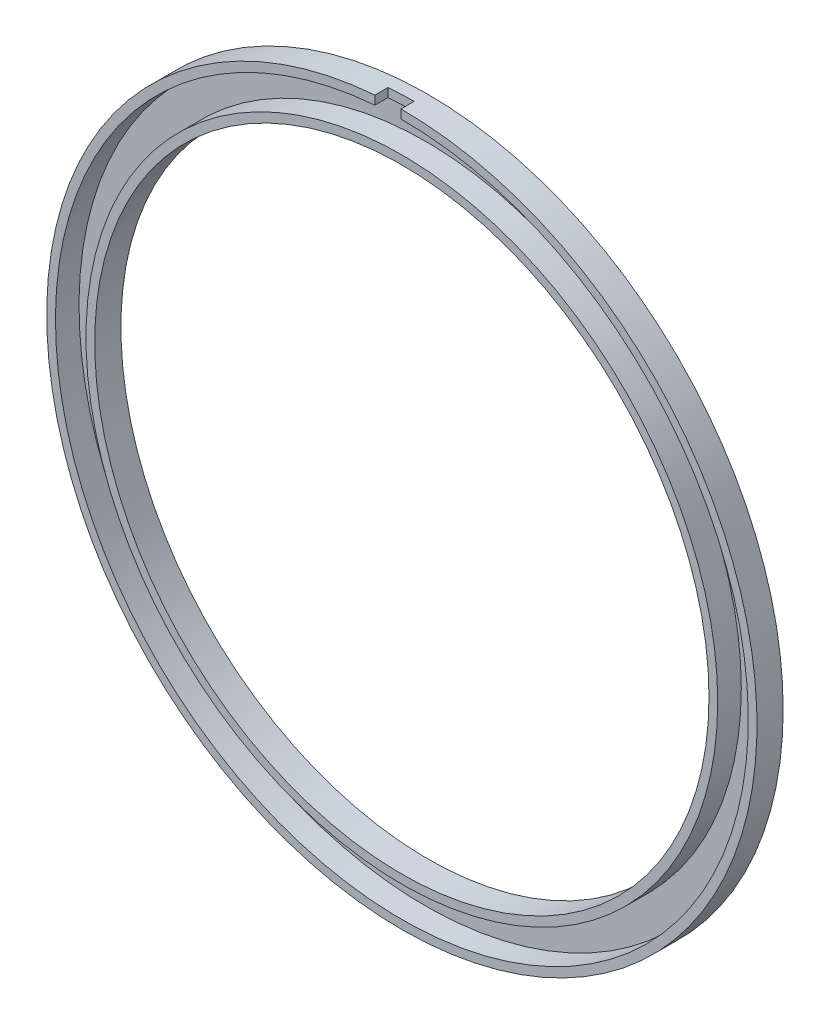
ISO-10303-21;
HEADER;
FILE_DESCRIPTION(('STEP AP214'),'2;1');
FILE_NAME('part.step','',(''),(''),'','','');
FILE_SCHEMA(('AUTOMOTIVE_DESIGN { 1 0 10303 214 1 1 1 1 }'));
ENDSEC;
DATA;
#1=APPLICATION_CONTEXT('core data for automotive mechanical design processes');
#2=APPLICATION_PROTOCOL_DEFINITION('international standard','automotive_design',2000,#1);
#3=PRODUCT_CONTEXT('',#1,'mechanical');
#4=PRODUCT('Part','Part','',(#3));
#5=PRODUCT_RELATED_PRODUCT_CATEGORY('part','',(#4));
#6=PRODUCT_DEFINITION_FORMATION('','',#4);
#7=PRODUCT_DEFINITION_CONTEXT('part definition',#1,'design');
#8=PRODUCT_DEFINITION('design','',#6,#7);
#9=PRODUCT_DEFINITION_SHAPE('','',#8);
#10=(LENGTH_UNIT() NAMED_UNIT(*) SI_UNIT(.MILLI.,.METRE.));
#11=(NAMED_UNIT(*) PLANE_ANGLE_UNIT() SI_UNIT($,.RADIAN.));
#12=(NAMED_UNIT(*) SI_UNIT($,.STERADIAN.) SOLID_ANGLE_UNIT());
#13=UNCERTAINTY_MEASURE_WITH_UNIT(LENGTH_MEASURE(1.E-05),#10,'distance_accuracy_value','');
#14=(GEOMETRIC_REPRESENTATION_CONTEXT(3) GLOBAL_UNCERTAINTY_ASSIGNED_CONTEXT((#13)) GLOBAL_UNIT_ASSIGNED_CONTEXT((#10,
#11,#12)) REPRESENTATION_CONTEXT('',''));
#15=CARTESIAN_POINT('',(0.,0.,0.));
#16=DIRECTION('',(0.,0.,1.));
#17=DIRECTION('',(1.,0.,0.));
#18=AXIS2_PLACEMENT_3D('',#15,#16,#17);
#19=CARTESIAN_POINT('',(0.,0.,0.6));
#20=DIRECTION('',(0.,0.,1.));
#21=DIRECTION('',(1.,0.,0.));
#22=AXIS2_PLACEMENT_3D('',#19,#20,#21);
#23=PLANE('',#22);
#24=CARTESIAN_POINT('',(0.,0.,0.6));
#25=DIRECTION('',(0.,0.,1.));
#26=DIRECTION('',(1.,0.,0.));
#27=AXIS2_PLACEMENT_3D('',#24,#25,#26);
#28=CIRCLE('',#27,72.4);
#29=CARTESIAN_POINT('',(72.4,0.,0.6));
#30=VERTEX_POINT('',#29);
#31=EDGE_CURVE('E58',#30,#30,#28,.T.);
#32=ORIENTED_EDGE('',*,*,#31,.F.);
#33=EDGE_LOOP('',(#32));
#34=FACE_BOUND('',#33,.T.);
#35=CARTESIAN_POINT('',(0.,0.,0.6));
#36=DIRECTION('',(0.,0.,1.));
#37=DIRECTION('',(1.,0.,0.));
#38=AXIS2_PLACEMENT_3D('',#35,#36,#37);
#39=CIRCLE('',#38,79.4);
#40=CARTESIAN_POINT('',(79.4,0.,0.6));
#41=VERTEX_POINT('',#40);
#42=EDGE_CURVE('E12',#41,#41,#39,.T.);
#43=ORIENTED_EDGE('',*,*,#42,.T.);
#44=EDGE_LOOP('',(#43));
#45=FACE_BOUND('',#44,.T.);
#46=ADVANCED_FACE('F50',(#34,#45),#23,.T.);
#47=CARTESIAN_POINT('',(0.,0.,0.));
#48=DIRECTION('',(0.,0.,1.));
#49=DIRECTION('',(1.,0.,0.));
#50=AXIS2_PLACEMENT_3D('',#47,#48,#49);
#51=PLANE('',#50);
#52=CARTESIAN_POINT('',(0.,0.,0.));
#53=DIRECTION('',(0.,0.,1.));
#54=DIRECTION('',(1.,0.,0.));
#55=AXIS2_PLACEMENT_3D('',#52,#53,#54);
#56=CIRCLE('',#55,81.4);
#57=CARTESIAN_POINT('',(81.4,0.,0.));
#58=VERTEX_POINT('',#57);
#59=EDGE_CURVE('E105',#58,#58,#56,.T.);
#60=ORIENTED_EDGE('',*,*,#59,.F.);
#61=EDGE_LOOP('',(#60));
#62=FACE_BOUND('',#61,.T.);
#63=CARTESIAN_POINT('',(0.,0.,0.));
#64=DIRECTION('',(0.,0.,1.));
#65=DIRECTION('',(1.,0.,0.));
#66=AXIS2_PLACEMENT_3D('',#63,#64,#65);
#67=CIRCLE('',#66,70.4);
#68=CARTESIAN_POINT('',(70.4,0.,0.));
#69=VERTEX_POINT('',#68);
#70=EDGE_CURVE('E95',#69,#69,#67,.T.);
#71=ORIENTED_EDGE('',*,*,#70,.T.);
#72=EDGE_LOOP('',(#71));
#73=FACE_BOUND('',#72,.T.);
#74=ADVANCED_FACE('F52',(#62,#73),#51,.F.);
#75=CARTESIAN_POINT('',(0.,0.,6.));
#76=DIRECTION('',(0.,0.,-1.));
#77=DIRECTION('',(-1.,0.,0.));
#78=AXIS2_PLACEMENT_3D('',#75,#76,#77);
#79=CYLINDRICAL_SURFACE('',#78,70.4);
#80=CARTESIAN_POINT('',(0.,0.,6.));
#81=DIRECTION('',(0.,0.,1.));
#82=DIRECTION('',(1.,0.,0.));
#83=AXIS2_PLACEMENT_3D('',#80,#81,#82);
#84=CIRCLE('',#83,70.4);
#85=CARTESIAN_POINT('',(70.4,0.,6.));
#86=VERTEX_POINT('',#85);
#87=EDGE_CURVE('E122',#86,#86,#84,.T.);
#88=ORIENTED_EDGE('',*,*,#87,.T.);
#89=EDGE_LOOP('',(#88));
#90=FACE_BOUND('',#89,.T.);
#91=ORIENTED_EDGE('',*,*,#70,.F.);
#92=EDGE_LOOP('',(#91));
#93=FACE_BOUND('',#92,.T.);
#94=ADVANCED_FACE('F154',(#90,#93),#79,.F.);
#95=CARTESIAN_POINT('',(0.,0.,6.));
#96=DIRECTION('',(0.,0.,-1.));
#97=DIRECTION('',(-1.,0.,0.));
#98=AXIS2_PLACEMENT_3D('',#95,#96,#97);
#99=CYLINDRICAL_SURFACE('',#98,72.4);
#100=ORIENTED_EDGE('',*,*,#31,.T.);
#101=EDGE_LOOP('',(#100));
#102=FACE_BOUND('',#101,.T.);
#103=CARTESIAN_POINT('',(0.,0.,6.));
#104=DIRECTION('',(0.,0.,1.));
#105=DIRECTION('',(1.,0.,0.));
#106=AXIS2_PLACEMENT_3D('',#103,#104,#105);
#107=CIRCLE('',#106,72.4);
#108=CARTESIAN_POINT('',(72.4,0.,6.));
#109=VERTEX_POINT('',#108);
#110=EDGE_CURVE('E125',#109,#109,#107,.T.);
#111=ORIENTED_EDGE('',*,*,#110,.F.);
#112=EDGE_LOOP('',(#111));
#113=FACE_BOUND('',#112,.T.);
#114=ADVANCED_FACE('F132',(#102,#113),#99,.T.);
#115=CARTESIAN_POINT('',(0.,0.,6.));
#116=DIRECTION('',(0.,0.,1.));
#117=DIRECTION('',(1.,0.,0.));
#118=AXIS2_PLACEMENT_3D('',#115,#116,#117);
#119=PLANE('',#118);
#120=ORIENTED_EDGE('',*,*,#87,.F.);
#121=EDGE_LOOP('',(#120));
#122=FACE_BOUND('',#121,.T.);
#123=ORIENTED_EDGE('',*,*,#110,.T.);
#124=EDGE_LOOP('',(#123));
#125=FACE_BOUND('',#124,.T.);
#126=ADVANCED_FACE('F140',(#122,#125),#119,.T.);
#127=CARTESIAN_POINT('',(0.,0.,6.));
#128=DIRECTION('',(0.,0.,-1.));
#129=DIRECTION('',(-1.,0.,0.));
#130=AXIS2_PLACEMENT_3D('',#127,#128,#129);
#131=CYLINDRICAL_SURFACE('',#130,79.4);
#132=ORIENTED_EDGE('',*,*,#42,.F.);
#133=EDGE_LOOP('',(#132));
#134=FACE_BOUND('',#133,.T.);
#135=DIRECTION('',(0.,0.,-1.));
#136=VECTOR('',#135,1.);
#137=CARTESIAN_POINT('',(-0.182652596853231,79.3997899117426,6.));
#138=LINE('',#137,#136);
#139=CARTESIAN_POINT('',(-0.182652596853231,79.3997899117426,6.));
#140=VERTEX_POINT('',#139);
#141=CARTESIAN_POINT('',(-0.182652596853231,79.3997899117426,3.));
#142=VERTEX_POINT('',#141);
#143=EDGE_CURVE('E115',#140,#142,#138,.T.);
#144=ORIENTED_EDGE('',*,*,#143,.T.);
#145=CARTESIAN_POINT('',(0.,0.,3.));
#146=DIRECTION('',(0.,0.,1.));
#147=DIRECTION('',(1.,0.,0.));
#148=AXIS2_PLACEMENT_3D('',#145,#146,#147);
#149=CIRCLE('',#148,79.4);
#150=CARTESIAN_POINT('',(-6.18265259685323,79.1589212083302,3.));
#151=VERTEX_POINT('',#150);
#152=EDGE_CURVE('E94',#142,#151,#149,.T.);
#153=ORIENTED_EDGE('',*,*,#152,.T.);
#154=DIRECTION('',(0.,0.,-1.));
#155=VECTOR('',#154,1.);
#156=CARTESIAN_POINT('',(-6.18265259685323,79.1589212083302,6.));
#157=LINE('',#156,#155);
#158=CARTESIAN_POINT('',(-6.18265259685323,79.1589212083302,6.));
#159=VERTEX_POINT('',#158);
#160=EDGE_CURVE('E65',#159,#151,#157,.T.);
#161=ORIENTED_EDGE('',*,*,#160,.F.);
#162=CARTESIAN_POINT('',(0.,0.,6.));
#163=DIRECTION('',(0.,0.,1.));
#164=DIRECTION('',(1.,0.,0.));
#165=AXIS2_PLACEMENT_3D('',#162,#163,#164);
#166=CIRCLE('',#165,79.4);
#167=EDGE_CURVE('E92',#159,#140,#166,.T.);
#168=ORIENTED_EDGE('',*,*,#167,.T.);
#169=EDGE_LOOP('',(#144,#153,#161,#168));
#170=FACE_BOUND('',#169,.T.);
#171=ADVANCED_FACE('F91',(#134,#170),#131,.F.);
#172=CARTESIAN_POINT('',(-6.18265259685326,0.,6.));
#173=DIRECTION('',(1.,0.,0.));
#174=DIRECTION('',(0.,1.,0.));
#175=AXIS2_PLACEMENT_3D('',#172,#173,#174);
#176=PLANE('',#175);
#177=DIRECTION('',(0.,-1.,0.));
#178=VECTOR('',#177,1.);
#179=CARTESIAN_POINT('',(-6.18265259685326,0.,3.));
#180=LINE('',#179,#178);
#181=CARTESIAN_POINT('',(-6.18265259685323,81.1648618976625,3.));
#182=VERTEX_POINT('',#181);
#183=EDGE_CURVE('E69',#182,#151,#180,.T.);
#184=ORIENTED_EDGE('',*,*,#183,.F.);
#185=DIRECTION('',(0.,0.,-1.));
#186=VECTOR('',#185,1.);
#187=CARTESIAN_POINT('',(-6.18265259685323,81.1648618976625,6.));
#188=LINE('',#187,#186);
#189=CARTESIAN_POINT('',(-6.18265259685323,81.1648618976625,6.));
#190=VERTEX_POINT('',#189);
#191=EDGE_CURVE('E96',#190,#182,#188,.T.);
#192=ORIENTED_EDGE('',*,*,#191,.F.);
#193=DIRECTION('',(0.,-1.,0.));
#194=VECTOR('',#193,1.);
#195=CARTESIAN_POINT('',(-6.18265259685326,0.,6.));
#196=LINE('',#195,#194);
#197=EDGE_CURVE('E101',#190,#159,#196,.T.);
#198=ORIENTED_EDGE('',*,*,#197,.T.);
#199=ORIENTED_EDGE('',*,*,#160,.T.);
#200=EDGE_LOOP('',(#184,#192,#198,#199));
#201=FACE_BOUND('',#200,.T.);
#202=ADVANCED_FACE('F107',(#201),#176,.T.);
#203=CARTESIAN_POINT('',(0.,0.,6.));
#204=DIRECTION('',(0.,0.,-1.));
#205=DIRECTION('',(-1.,0.,0.));
#206=AXIS2_PLACEMENT_3D('',#203,#204,#205);
#207=CYLINDRICAL_SURFACE('',#206,81.4);
#208=ORIENTED_EDGE('',*,*,#59,.T.);
#209=EDGE_LOOP('',(#208));
#210=FACE_BOUND('',#209,.T.);
#211=ORIENTED_EDGE('',*,*,#191,.T.);
#212=CARTESIAN_POINT('',(0.,0.,3.));
#213=DIRECTION('',(0.,0.,1.));
#214=DIRECTION('',(1.,0.,0.));
#215=AXIS2_PLACEMENT_3D('',#212,#213,#214);
#216=CIRCLE('',#215,81.4);
#217=CARTESIAN_POINT('',(-0.187253417932657,81.399784619847,3.));
#218=VERTEX_POINT('',#217);
#219=EDGE_CURVE('E177',#218,#182,#216,.T.);
#220=ORIENTED_EDGE('',*,*,#219,.F.);
#221=DIRECTION('',(0.,0.,-1.));
#222=VECTOR('',#221,1.);
#223=CARTESIAN_POINT('',(-0.187253417932657,81.399784619847,6.));
#224=LINE('',#223,#222);
#225=CARTESIAN_POINT('',(-0.187253417932657,81.399784619847,6.));
#226=VERTEX_POINT('',#225);
#227=EDGE_CURVE('E119',#226,#218,#224,.T.);
#228=ORIENTED_EDGE('',*,*,#227,.F.);
#229=CARTESIAN_POINT('',(0.,0.,6.));
#230=DIRECTION('',(0.,0.,1.));
#231=DIRECTION('',(1.,0.,0.));
#232=AXIS2_PLACEMENT_3D('',#229,#230,#231);
#233=CIRCLE('',#232,81.4);
#234=EDGE_CURVE('E109',#190,#226,#233,.T.);
#235=ORIENTED_EDGE('',*,*,#234,.F.);
#236=EDGE_LOOP('',(#211,#220,#228,#235));
#237=FACE_BOUND('',#236,.T.);
#238=ADVANCED_FACE('F146',(#210,#237),#207,.T.);
#239=CARTESIAN_POINT('',(0.,0.,6.));
#240=DIRECTION('',(0.999997354052174,0.00230041053971323,0.));
#241=DIRECTION('',(-0.00230041053971323,0.999997354052174,0.));
#242=AXIS2_PLACEMENT_3D('',#239,#240,#241);
#243=PLANE('',#242);
#244=ORIENTED_EDGE('',*,*,#227,.T.);
#245=DIRECTION('',(0.00230041053971323,-0.999997354052174,0.));
#246=VECTOR('',#245,1.);
#247=CARTESIAN_POINT('',(0.,0.,3.));
#248=LINE('',#247,#246);
#249=EDGE_CURVE('E181',#218,#142,#248,.T.);
#250=ORIENTED_EDGE('',*,*,#249,.T.);
#251=ORIENTED_EDGE('',*,*,#143,.F.);
#252=DIRECTION('',(0.00230041053971323,-0.999997354052174,0.));
#253=VECTOR('',#252,1.);
#254=CARTESIAN_POINT('',(0.,0.,6.));
#255=LINE('',#254,#253);
#256=EDGE_CURVE('E103',#226,#140,#255,.T.);
#257=ORIENTED_EDGE('',*,*,#256,.F.);
#258=EDGE_LOOP('',(#244,#250,#251,#257));
#259=FACE_BOUND('',#258,.T.);
#260=ADVANCED_FACE('F173',(#259),#243,.F.);
#261=CARTESIAN_POINT('',(0.,0.,6.));
#262=DIRECTION('',(0.,0.,1.));
#263=DIRECTION('',(1.,0.,0.));
#264=AXIS2_PLACEMENT_3D('',#261,#262,#263);
#265=PLANE('',#264);
#266=ORIENTED_EDGE('',*,*,#167,.F.);
#267=ORIENTED_EDGE('',*,*,#197,.F.);
#268=ORIENTED_EDGE('',*,*,#234,.T.);
#269=ORIENTED_EDGE('',*,*,#256,.T.);
#270=EDGE_LOOP('',(#266,#267,#268,#269));
#271=FACE_BOUND('',#270,.T.);
#272=ADVANCED_FACE('F100',(#271),#265,.T.);
#273=CARTESIAN_POINT('',(0.,0.,3.));
#274=DIRECTION('',(0.,0.,1.));
#275=DIRECTION('',(1.,0.,0.));
#276=AXIS2_PLACEMENT_3D('',#273,#274,#275);
#277=PLANE('',#276);
#278=ORIENTED_EDGE('',*,*,#152,.F.);
#279=ORIENTED_EDGE('',*,*,#249,.F.);
#280=ORIENTED_EDGE('',*,*,#219,.T.);
#281=ORIENTED_EDGE('',*,*,#183,.T.);
#282=EDGE_LOOP('',(#278,#279,#280,#281));
#283=FACE_BOUND('',#282,.T.);
#284=ADVANCED_FACE('F180',(#283),#277,.T.);
#285=CLOSED_SHELL('',(#46,#74,#94,#114,#126,#171,#202,#238,#260,#272,#284));
#286=MANIFOLD_SOLID_BREP('B2',#285);
#287=ADVANCED_BREP_SHAPE_REPRESENTATION('',(#18,#286),#14);
#288=SHAPE_DEFINITION_REPRESENTATION(#9,#287);
ENDSEC;
END-ISO-10303-21;
